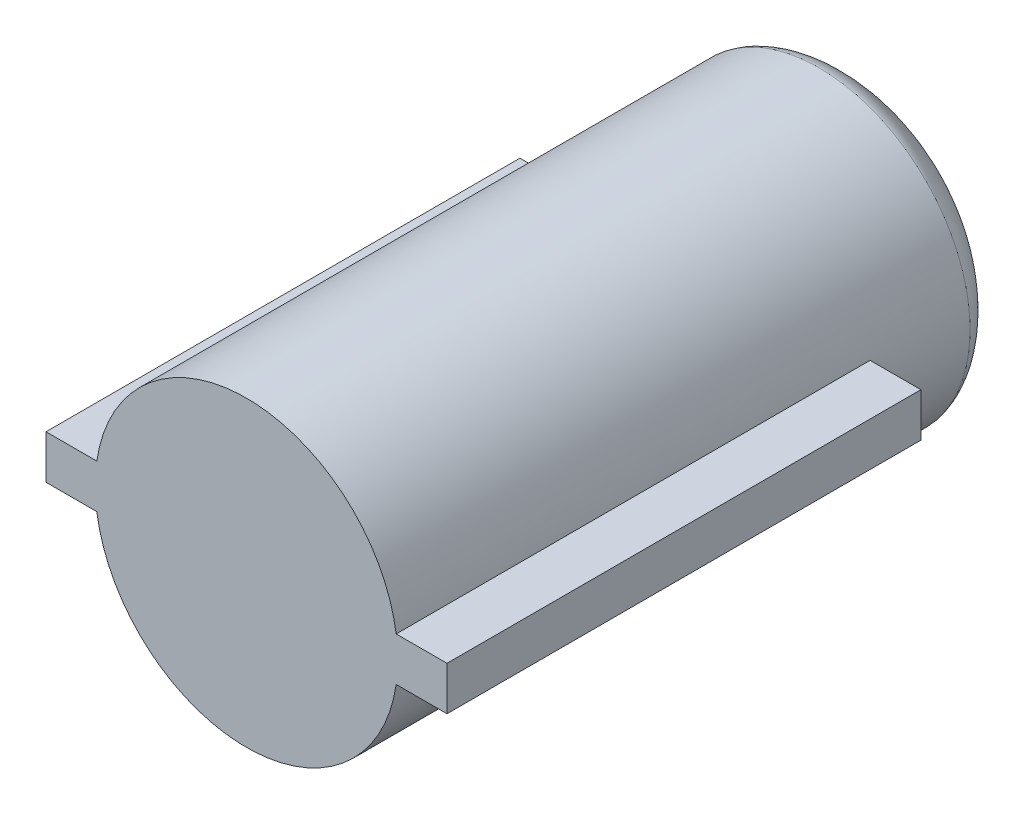
ISO-10303-21;
HEADER;
FILE_DESCRIPTION(('STEP AP214'),'2;1');
FILE_NAME('part.step','',(''),(''),'','','');
FILE_SCHEMA(('AUTOMOTIVE_DESIGN { 1 0 10303 214 1 1 1 1 }'));
ENDSEC;
DATA;
#1=APPLICATION_CONTEXT('core data for automotive mechanical design processes');
#2=APPLICATION_PROTOCOL_DEFINITION('international standard','automotive_design',2000,#1);
#3=PRODUCT_CONTEXT('',#1,'mechanical');
#4=PRODUCT('Part','Part','',(#3));
#5=PRODUCT_RELATED_PRODUCT_CATEGORY('part','',(#4));
#6=PRODUCT_DEFINITION_FORMATION('','',#4);
#7=PRODUCT_DEFINITION_CONTEXT('part definition',#1,'design');
#8=PRODUCT_DEFINITION('design','',#6,#7);
#9=PRODUCT_DEFINITION_SHAPE('','',#8);
#10=(LENGTH_UNIT() NAMED_UNIT(*) SI_UNIT(.MILLI.,.METRE.));
#11=(NAMED_UNIT(*) PLANE_ANGLE_UNIT() SI_UNIT($,.RADIAN.));
#12=(NAMED_UNIT(*) SI_UNIT($,.STERADIAN.) SOLID_ANGLE_UNIT());
#13=UNCERTAINTY_MEASURE_WITH_UNIT(LENGTH_MEASURE(1.E-05),#10,'distance_accuracy_value','');
#14=(GEOMETRIC_REPRESENTATION_CONTEXT(3) GLOBAL_UNCERTAINTY_ASSIGNED_CONTEXT((#13)) GLOBAL_UNIT_ASSIGNED_CONTEXT((#10,
#11,#12)) REPRESENTATION_CONTEXT('',''));
#15=CARTESIAN_POINT('',(0.,0.,0.));
#16=DIRECTION('',(0.,0.,1.));
#17=DIRECTION('',(1.,0.,0.));
#18=AXIS2_PLACEMENT_3D('',#15,#16,#17);
#19=CARTESIAN_POINT('',(0.,0.,17.2));
#20=DIRECTION('',(0.,0.,-1.));
#21=DIRECTION('',(-1.,0.,0.));
#22=AXIS2_PLACEMENT_3D('',#19,#20,#21);
#23=CYLINDRICAL_SURFACE('',#22,4.15);
#24=CARTESIAN_POINT('',(0.,0.,1.50000000000001));
#25=DIRECTION('',(0.,0.,-1.));
#26=DIRECTION('',(-1.,0.,0.));
#27=AXIS2_PLACEMENT_3D('',#24,#25,#26);
#28=CIRCLE('',#27,4.15);
#29=CARTESIAN_POINT('',(-4.15,0.,1.50000000000001));
#30=VERTEX_POINT('',#29);
#31=EDGE_CURVE('E129',#30,#30,#28,.T.);
#32=ORIENTED_EDGE('',*,*,#31,.F.);
#33=EDGE_LOOP('',(#32));
#34=FACE_BOUND('',#33,.T.);
#35=CARTESIAN_POINT('',(0.,0.,4.2));
#36=DIRECTION('',(0.,0.,1.));
#37=DIRECTION('',(1.,0.,0.));
#38=AXIS2_PLACEMENT_3D('',#35,#36,#37);
#39=CIRCLE('',#38,4.15);
#40=CARTESIAN_POINT('',(-4.10639744788543,0.599999999999999,4.2));
#41=VERTEX_POINT('',#40);
#42=CARTESIAN_POINT('',(-4.10639744788543,-0.600000000000001,4.2));
#43=VERTEX_POINT('',#42);
#44=EDGE_CURVE('E11',#41,#43,#39,.T.);
#45=ORIENTED_EDGE('',*,*,#44,.F.);
#46=DIRECTION('',(0.,0.,-1.));
#47=VECTOR('',#46,1.);
#48=CARTESIAN_POINT('',(-4.10639744788543,0.599999999999999,17.2));
#49=LINE('',#48,#47);
#50=CARTESIAN_POINT('',(-4.10639744788543,0.599999999999999,17.2));
#51=VERTEX_POINT('',#50);
#52=EDGE_CURVE('E153',#41,#51,#49,.F.);
#53=ORIENTED_EDGE('',*,*,#52,.T.);
#54=CARTESIAN_POINT('',(0.,0.,17.2));
#55=DIRECTION('',(0.,0.,1.));
#56=DIRECTION('',(1.,0.,0.));
#57=AXIS2_PLACEMENT_3D('',#54,#55,#56);
#58=CIRCLE('',#57,4.15);
#59=CARTESIAN_POINT('',(4.10639744788543,0.6,17.2));
#60=VERTEX_POINT('',#59);
#61=EDGE_CURVE('E159',#60,#51,#58,.T.);
#62=ORIENTED_EDGE('',*,*,#61,.F.);
#63=DIRECTION('',(0.,0.,-1.));
#64=VECTOR('',#63,1.);
#65=CARTESIAN_POINT('',(4.10639744788543,0.6,17.2));
#66=LINE('',#65,#64);
#67=CARTESIAN_POINT('',(4.10639744788543,0.6,4.2));
#68=VERTEX_POINT('',#67);
#69=EDGE_CURVE('E156',#60,#68,#66,.T.);
#70=ORIENTED_EDGE('',*,*,#69,.T.);
#71=CARTESIAN_POINT('',(4.10639744788543,-0.6,4.2));
#72=VERTEX_POINT('',#71);
#73=EDGE_CURVE('E39',#72,#68,#39,.T.);
#74=ORIENTED_EDGE('',*,*,#73,.F.);
#75=DIRECTION('',(0.,0.,-1.));
#76=VECTOR('',#75,1.);
#77=CARTESIAN_POINT('',(4.10639744788543,-0.599999999999999,17.2));
#78=LINE('',#77,#76);
#79=CARTESIAN_POINT('',(4.10639744788543,-0.6,17.2));
#80=VERTEX_POINT('',#79);
#81=EDGE_CURVE('E144',#72,#80,#78,.F.);
#82=ORIENTED_EDGE('',*,*,#81,.T.);
#83=CARTESIAN_POINT('',(-4.10639744788543,-0.600000000000001,17.2));
#84=VERTEX_POINT('',#83);
#85=EDGE_CURVE('E158',#84,#80,#58,.T.);
#86=ORIENTED_EDGE('',*,*,#85,.F.);
#87=DIRECTION('',(0.,0.,-1.));
#88=VECTOR('',#87,1.);
#89=CARTESIAN_POINT('',(-4.10639744788543,-0.6,17.2));
#90=LINE('',#89,#88);
#91=EDGE_CURVE('E151',#84,#43,#90,.T.);
#92=ORIENTED_EDGE('',*,*,#91,.T.);
#93=EDGE_LOOP('',(#45,#53,#62,#70,#74,#82,#86,#92));
#94=FACE_BOUND('',#93,.T.);
#95=ADVANCED_FACE('F36',(#34,#94),#23,.T.);
#96=CARTESIAN_POINT('',(0.,0.,17.2));
#97=DIRECTION('',(0.,0.,1.));
#98=DIRECTION('',(1.,0.,0.));
#99=AXIS2_PLACEMENT_3D('',#96,#97,#98);
#100=PLANE('',#99);
#101=ORIENTED_EDGE('',*,*,#85,.T.);
#102=DIRECTION('',(1.,0.,0.));
#103=VECTOR('',#102,1.);
#104=CARTESIAN_POINT('',(5.5,-0.599999999999999,17.2));
#105=LINE('',#104,#103);
#106=CARTESIAN_POINT('',(5.5,-0.599999999999999,17.2));
#107=VERTEX_POINT('',#106);
#108=EDGE_CURVE('E139',#80,#107,#105,.T.);
#109=ORIENTED_EDGE('',*,*,#108,.T.);
#110=DIRECTION('',(0.,1.,0.));
#111=VECTOR('',#110,1.);
#112=CARTESIAN_POINT('',(5.5,-0.599999999999999,17.2));
#113=LINE('',#112,#111);
#114=CARTESIAN_POINT('',(5.5,0.600000000000001,17.2));
#115=VERTEX_POINT('',#114);
#116=EDGE_CURVE('E141',#107,#115,#113,.T.);
#117=ORIENTED_EDGE('',*,*,#116,.T.);
#118=DIRECTION('',(-1.,0.,0.));
#119=VECTOR('',#118,1.);
#120=CARTESIAN_POINT('',(5.5,0.600000000000001,17.2));
#121=LINE('',#120,#119);
#122=EDGE_CURVE('E57',#115,#60,#121,.T.);
#123=ORIENTED_EDGE('',*,*,#122,.T.);
#124=ORIENTED_EDGE('',*,*,#61,.T.);
#125=CARTESIAN_POINT('',(-5.5,0.599999999999999,17.2));
#126=VERTEX_POINT('',#125);
#127=EDGE_CURVE('E126',#51,#126,#121,.T.);
#128=ORIENTED_EDGE('',*,*,#127,.T.);
#129=DIRECTION('',(0.,-1.,0.));
#130=VECTOR('',#129,1.);
#131=CARTESIAN_POINT('',(-5.5,-0.600000000000001,17.2));
#132=LINE('',#131,#130);
#133=CARTESIAN_POINT('',(-5.5,-0.600000000000001,17.2));
#134=VERTEX_POINT('',#133);
#135=EDGE_CURVE('E137',#126,#134,#132,.T.);
#136=ORIENTED_EDGE('',*,*,#135,.T.);
#137=EDGE_CURVE('E50',#134,#84,#105,.T.);
#138=ORIENTED_EDGE('',*,*,#137,.T.);
#139=EDGE_LOOP('',(#101,#109,#117,#123,#124,#128,#136,#138));
#140=FACE_BOUND('',#139,.T.);
#141=ADVANCED_FACE('F162',(#140),#100,.T.);
#142=CARTESIAN_POINT('',(5.5,-0.599999999999999,4.2));
#143=DIRECTION('',(1.,0.,0.));
#144=DIRECTION('',(0.,0.,-1.));
#145=AXIS2_PLACEMENT_3D('',#142,#143,#144);
#146=PLANE('',#145);
#147=ORIENTED_EDGE('',*,*,#116,.F.);
#148=DIRECTION('',(0.,0.,1.));
#149=VECTOR('',#148,1.);
#150=CARTESIAN_POINT('',(5.5,-0.599999999999999,4.2));
#151=LINE('',#150,#149);
#152=CARTESIAN_POINT('',(5.5,-0.599999999999999,4.2));
#153=VERTEX_POINT('',#152);
#154=EDGE_CURVE('E109',#153,#107,#151,.T.);
#155=ORIENTED_EDGE('',*,*,#154,.F.);
#156=DIRECTION('',(0.,1.,0.));
#157=VECTOR('',#156,1.);
#158=CARTESIAN_POINT('',(5.5,-0.599999999999999,4.2));
#159=LINE('',#158,#157);
#160=CARTESIAN_POINT('',(5.5,0.600000000000001,4.2));
#161=VERTEX_POINT('',#160);
#162=EDGE_CURVE('E118',#153,#161,#159,.T.);
#163=ORIENTED_EDGE('',*,*,#162,.T.);
#164=DIRECTION('',(0.,0.,1.));
#165=VECTOR('',#164,1.);
#166=CARTESIAN_POINT('',(5.5,0.600000000000001,4.2));
#167=LINE('',#166,#165);
#168=EDGE_CURVE('E145',#161,#115,#167,.T.);
#169=ORIENTED_EDGE('',*,*,#168,.T.);
#170=EDGE_LOOP('',(#147,#155,#163,#169));
#171=FACE_BOUND('',#170,.T.);
#172=ADVANCED_FACE('F175',(#171),#146,.T.);
#173=CARTESIAN_POINT('',(0.,0.,4.2));
#174=DIRECTION('',(0.,0.,1.));
#175=DIRECTION('',(1.,0.,0.));
#176=AXIS2_PLACEMENT_3D('',#173,#174,#175);
#177=PLANE('',#176);
#178=DIRECTION('',(1.,0.,0.));
#179=VECTOR('',#178,1.);
#180=CARTESIAN_POINT('',(5.5,-0.599999999999999,4.2));
#181=LINE('',#180,#179);
#182=EDGE_CURVE('E119',#72,#153,#181,.T.);
#183=ORIENTED_EDGE('',*,*,#182,.F.);
#184=ORIENTED_EDGE('',*,*,#73,.T.);
#185=DIRECTION('',(-1.,0.,0.));
#186=VECTOR('',#185,1.);
#187=CARTESIAN_POINT('',(5.5,0.600000000000001,4.2));
#188=LINE('',#187,#186);
#189=EDGE_CURVE('E110',#161,#68,#188,.T.);
#190=ORIENTED_EDGE('',*,*,#189,.F.);
#191=ORIENTED_EDGE('',*,*,#162,.F.);
#192=EDGE_LOOP('',(#183,#184,#190,#191));
#193=FACE_BOUND('',#192,.T.);
#194=ADVANCED_FACE('F171',(#193),#177,.F.);
#195=CARTESIAN_POINT('',(5.5,-0.599999999999999,4.2));
#196=DIRECTION('',(0.,-1.,0.));
#197=DIRECTION('',(1.,0.,0.));
#198=AXIS2_PLACEMENT_3D('',#195,#196,#197);
#199=PLANE('',#198);
#200=ORIENTED_EDGE('',*,*,#81,.F.);
#201=ORIENTED_EDGE('',*,*,#182,.T.);
#202=ORIENTED_EDGE('',*,*,#154,.T.);
#203=ORIENTED_EDGE('',*,*,#108,.F.);
#204=EDGE_LOOP('',(#200,#201,#202,#203));
#205=FACE_BOUND('',#204,.T.);
#206=ADVANCED_FACE('F167',(#205),#199,.T.);
#207=CARTESIAN_POINT('',(5.5,0.600000000000001,4.2));
#208=DIRECTION('',(0.,1.,0.));
#209=DIRECTION('',(-1.,0.,0.));
#210=AXIS2_PLACEMENT_3D('',#207,#208,#209);
#211=PLANE('',#210);
#212=ORIENTED_EDGE('',*,*,#69,.F.);
#213=ORIENTED_EDGE('',*,*,#122,.F.);
#214=ORIENTED_EDGE('',*,*,#168,.F.);
#215=ORIENTED_EDGE('',*,*,#189,.T.);
#216=EDGE_LOOP('',(#212,#213,#214,#215));
#217=FACE_BOUND('',#216,.T.);
#218=ADVANCED_FACE('F177',(#217),#211,.T.);
#219=CARTESIAN_POINT('',(-5.5,0.599999999999999,4.2));
#220=VERTEX_POINT('',#219);
#221=EDGE_CURVE('E134',#41,#220,#188,.T.);
#222=ORIENTED_EDGE('',*,*,#221,.F.);
#223=ORIENTED_EDGE('',*,*,#44,.T.);
#224=CARTESIAN_POINT('',(-5.5,-0.600000000000001,4.2));
#225=VERTEX_POINT('',#224);
#226=EDGE_CURVE('E104',#225,#43,#181,.T.);
#227=ORIENTED_EDGE('',*,*,#226,.F.);
#228=DIRECTION('',(0.,-1.,0.));
#229=VECTOR('',#228,1.);
#230=CARTESIAN_POINT('',(-5.5,-0.600000000000001,4.2));
#231=LINE('',#230,#229);
#232=EDGE_CURVE('E116',#220,#225,#231,.T.);
#233=ORIENTED_EDGE('',*,*,#232,.F.);
#234=EDGE_LOOP('',(#222,#223,#227,#233));
#235=FACE_BOUND('',#234,.T.);
#236=ADVANCED_FACE('F115',(#235),#177,.F.);
#237=ORIENTED_EDGE('',*,*,#52,.F.);
#238=ORIENTED_EDGE('',*,*,#221,.T.);
#239=DIRECTION('',(0.,0.,1.));
#240=VECTOR('',#239,1.);
#241=CARTESIAN_POINT('',(-5.5,0.599999999999999,4.2));
#242=LINE('',#241,#240);
#243=EDGE_CURVE('E124',#220,#126,#242,.T.);
#244=ORIENTED_EDGE('',*,*,#243,.T.);
#245=ORIENTED_EDGE('',*,*,#127,.F.);
#246=EDGE_LOOP('',(#237,#238,#244,#245));
#247=FACE_BOUND('',#246,.T.);
#248=ADVANCED_FACE('F179',(#247),#211,.T.);
#249=ORIENTED_EDGE('',*,*,#91,.F.);
#250=ORIENTED_EDGE('',*,*,#137,.F.);
#251=DIRECTION('',(0.,0.,1.));
#252=VECTOR('',#251,1.);
#253=CARTESIAN_POINT('',(-5.5,-0.600000000000001,4.2));
#254=LINE('',#253,#252);
#255=EDGE_CURVE('E101',#225,#134,#254,.T.);
#256=ORIENTED_EDGE('',*,*,#255,.F.);
#257=ORIENTED_EDGE('',*,*,#226,.T.);
#258=EDGE_LOOP('',(#249,#250,#256,#257));
#259=FACE_BOUND('',#258,.T.);
#260=ADVANCED_FACE('F103',(#259),#199,.T.);
#261=CARTESIAN_POINT('',(-5.5,-0.600000000000001,4.2));
#262=DIRECTION('',(-1.,0.,0.));
#263=DIRECTION('',(0.,0.,1.));
#264=AXIS2_PLACEMENT_3D('',#261,#262,#263);
#265=PLANE('',#264);
#266=ORIENTED_EDGE('',*,*,#135,.F.);
#267=ORIENTED_EDGE('',*,*,#243,.F.);
#268=ORIENTED_EDGE('',*,*,#232,.T.);
#269=ORIENTED_EDGE('',*,*,#255,.T.);
#270=EDGE_LOOP('',(#266,#267,#268,#269));
#271=FACE_BOUND('',#270,.T.);
#272=ADVANCED_FACE('F122',(#271),#265,.T.);
#273=CARTESIAN_POINT('',(0.,4.15,1.50000000000001));
#274=CARTESIAN_POINT('',(0.,4.05537317860218,0.922815805737262));
#275=CARTESIAN_POINT('',(0.,2.84655662610956,-0.00317399949750981));
#276=CARTESIAN_POINT('',(0.,1.43187539710622,0.));
#277=B_SPLINE_CURVE_WITH_KNOTS('',3,(#273,#274,#275,#276),.UNSPECIFIED.,.F.,.F.,(4,4),(0.,
0.91074495904114),.UNSPECIFIED.);
#278=CARTESIAN_POINT('',(0.,0.,0.));
#279=DIRECTION('',(0.,0.,-1.));
#280=AXIS1_PLACEMENT('',#278,#279);
#281=SURFACE_OF_REVOLUTION('',#277,#280);
#282=CARTESIAN_POINT('',(0.,0.,0.));
#283=DIRECTION('',(0.,0.,-1.));
#284=DIRECTION('',(-1.,0.,0.));
#285=AXIS2_PLACEMENT_3D('',#282,#283,#284);
#286=CIRCLE('',#285,1.43187539710622);
#287=CARTESIAN_POINT('',(-1.43187539710622,0.,0.));
#288=VERTEX_POINT('',#287);
#289=EDGE_CURVE('E199',#288,#288,#286,.T.);
#290=ORIENTED_EDGE('',*,*,#289,.F.);
#291=EDGE_LOOP('',(#290));
#292=FACE_BOUND('',#291,.T.);
#293=ORIENTED_EDGE('',*,*,#31,.T.);
#294=EDGE_LOOP('',(#293));
#295=FACE_BOUND('',#294,.T.);
#296=ADVANCED_FACE('F211',(#292,#295),#281,.T.);
#297=CARTESIAN_POINT('',(0.,0.,0.));
#298=DIRECTION('',(0.,0.,1.));
#299=DIRECTION('',(1.,0.,0.));
#300=AXIS2_PLACEMENT_3D('',#297,#298,#299);
#301=PLANE('',#300);
#302=ORIENTED_EDGE('',*,*,#289,.T.);
#303=EDGE_LOOP('',(#302));
#304=FACE_BOUND('',#303,.T.);
#305=ADVANCED_FACE('F213',(#304),#301,.F.);
#306=CLOSED_SHELL('',(#95,#141,#172,#194,#206,#218,#236,#248,#260,#272,#296,#305));
#307=MANIFOLD_SOLID_BREP('B2',#306);
#308=ADVANCED_BREP_SHAPE_REPRESENTATION('',(#18,#307),#14);
#309=SHAPE_DEFINITION_REPRESENTATION(#9,#308);
ENDSEC;
END-ISO-10303-21;
